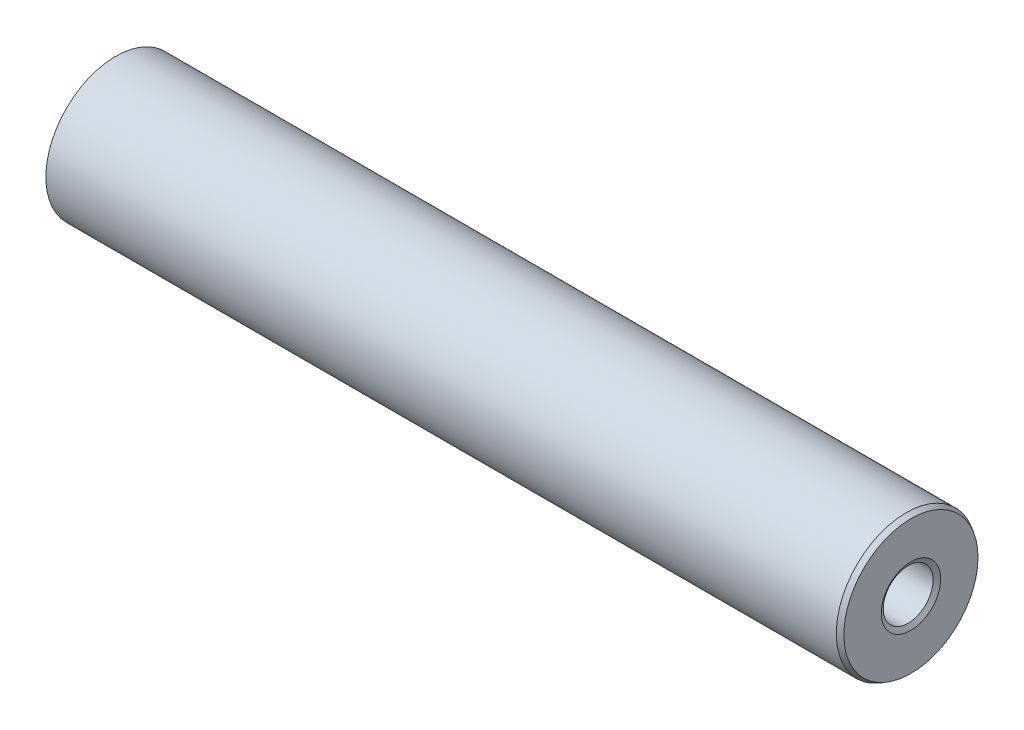
ISO-10303-21;
HEADER;
FILE_DESCRIPTION(('STEP AP214'),'2;1');
FILE_NAME('part.step','',(''),(''),'','','');
FILE_SCHEMA(('AUTOMOTIVE_DESIGN { 1 0 10303 214 1 1 1 1 }'));
ENDSEC;
DATA;
#1=APPLICATION_CONTEXT('core data for automotive mechanical design processes');
#2=APPLICATION_PROTOCOL_DEFINITION('international standard','automotive_design',2000,#1);
#3=PRODUCT_CONTEXT('',#1,'mechanical');
#4=PRODUCT('Part','Part','',(#3));
#5=PRODUCT_RELATED_PRODUCT_CATEGORY('part','',(#4));
#6=PRODUCT_DEFINITION_FORMATION('','',#4);
#7=PRODUCT_DEFINITION_CONTEXT('part definition',#1,'design');
#8=PRODUCT_DEFINITION('design','',#6,#7);
#9=PRODUCT_DEFINITION_SHAPE('','',#8);
#10=(LENGTH_UNIT() NAMED_UNIT(*) SI_UNIT(.MILLI.,.METRE.));
#11=(NAMED_UNIT(*) PLANE_ANGLE_UNIT() SI_UNIT($,.RADIAN.));
#12=(NAMED_UNIT(*) SI_UNIT($,.STERADIAN.) SOLID_ANGLE_UNIT());
#13=UNCERTAINTY_MEASURE_WITH_UNIT(LENGTH_MEASURE(1.E-05),#10,'distance_accuracy_value','');
#14=(GEOMETRIC_REPRESENTATION_CONTEXT(3) GLOBAL_UNCERTAINTY_ASSIGNED_CONTEXT((#13)) GLOBAL_UNIT_ASSIGNED_CONTEXT((#10,
#11,#12)) REPRESENTATION_CONTEXT('',''));
#15=CARTESIAN_POINT('',(0.,0.,0.));
#16=DIRECTION('',(0.,0.,1.));
#17=DIRECTION('',(1.,0.,0.));
#18=AXIS2_PLACEMENT_3D('',#15,#16,#17);
#19=CARTESIAN_POINT('',(127.,0.,0.));
#20=DIRECTION('',(1.,0.,0.));
#21=DIRECTION('',(0.,0.,-1.));
#22=AXIS2_PLACEMENT_3D('',#19,#20,#21);
#23=PLANE('',#22);
#24=CARTESIAN_POINT('',(127.,0.,0.));
#25=DIRECTION('',(1.,0.,0.));
#26=DIRECTION('',(0.,0.,-1.));
#27=AXIS2_PLACEMENT_3D('',#24,#25,#26);
#28=CIRCLE('',#27,10.6725590948775);
#29=CARTESIAN_POINT('',(127.,0.,-10.6725590948775));
#30=VERTEX_POINT('',#29);
#31=EDGE_CURVE('E59',#30,#30,#28,.T.);
#32=ORIENTED_EDGE('',*,*,#31,.T.);
#33=EDGE_LOOP('',(#32));
#34=FACE_BOUND('',#33,.T.);
#35=CARTESIAN_POINT('',(127.,0.,0.));
#36=DIRECTION('',(1.,0.,0.));
#37=DIRECTION('',(0.,0.,-1.));
#38=AXIS2_PLACEMENT_3D('',#35,#36,#37);
#39=CIRCLE('',#38,4.73074999999998);
#40=CARTESIAN_POINT('',(127.,0.,-4.73074999999998));
#41=VERTEX_POINT('',#40);
#42=EDGE_CURVE('E62',#41,#41,#39,.F.);
#43=ORIENTED_EDGE('',*,*,#42,.T.);
#44=EDGE_LOOP('',(#43));
#45=FACE_BOUND('',#44,.T.);
#46=ADVANCED_FACE('F33',(#34,#45),#23,.T.);
#47=CARTESIAN_POINT('',(0.,0.,0.));
#48=DIRECTION('',(1.,0.,0.));
#49=DIRECTION('',(0.,0.,-1.));
#50=AXIS2_PLACEMENT_3D('',#47,#48,#49);
#51=PLANE('',#50);
#52=CARTESIAN_POINT('',(0.,0.,0.));
#53=DIRECTION('',(1.,0.,0.));
#54=DIRECTION('',(0.,0.,-1.));
#55=AXIS2_PLACEMENT_3D('',#52,#53,#54);
#56=CIRCLE('',#55,4.40869090512248);
#57=CARTESIAN_POINT('',(0.,0.,-4.40869090512248));
#58=VERTEX_POINT('',#57);
#59=EDGE_CURVE('E10',#58,#58,#56,.T.);
#60=ORIENTED_EDGE('',*,*,#59,.T.);
#61=EDGE_LOOP('',(#60));
#62=FACE_BOUND('',#61,.T.);
#63=CARTESIAN_POINT('',(0.,0.,0.));
#64=DIRECTION('',(1.,0.,0.));
#65=DIRECTION('',(0.,0.,-1.));
#66=AXIS2_PLACEMENT_3D('',#63,#64,#65);
#67=CIRCLE('',#66,10.3505);
#68=CARTESIAN_POINT('',(0.,0.,-10.3505));
#69=VERTEX_POINT('',#68);
#70=EDGE_CURVE('E40',#69,#69,#67,.F.);
#71=ORIENTED_EDGE('',*,*,#70,.T.);
#72=EDGE_LOOP('',(#71));
#73=FACE_BOUND('',#72,.T.);
#74=ADVANCED_FACE('F89',(#62,#73),#51,.F.);
#75=CARTESIAN_POINT('',(127.,0.,0.));
#76=DIRECTION('',(-1.,0.,0.));
#77=DIRECTION('',(0.,0.,1.));
#78=AXIS2_PLACEMENT_3D('',#75,#76,#77);
#79=CYLINDRICAL_SURFACE('',#78,11.1125);
#80=CARTESIAN_POINT('',(126.238,0.,0.));
#81=DIRECTION('',(1.,0.,0.));
#82=DIRECTION('',(0.,0.,-1.));
#83=AXIS2_PLACEMENT_3D('',#80,#81,#82);
#84=CIRCLE('',#83,11.1125);
#85=CARTESIAN_POINT('',(126.238,0.,-11.1125));
#86=VERTEX_POINT('',#85);
#87=EDGE_CURVE('E53',#86,#86,#84,.F.);
#88=ORIENTED_EDGE('',*,*,#87,.T.);
#89=EDGE_LOOP('',(#88));
#90=FACE_BOUND('',#89,.T.);
#91=CARTESIAN_POINT('',(0.439940905122504,0.,0.));
#92=DIRECTION('',(1.,0.,0.));
#93=DIRECTION('',(0.,0.,-1.));
#94=AXIS2_PLACEMENT_3D('',#91,#92,#93);
#95=CIRCLE('',#94,11.1125);
#96=CARTESIAN_POINT('',(0.439940905122504,0.,-11.1125));
#97=VERTEX_POINT('',#96);
#98=EDGE_CURVE('E56',#97,#97,#95,.T.);
#99=ORIENTED_EDGE('',*,*,#98,.T.);
#100=EDGE_LOOP('',(#99));
#101=FACE_BOUND('',#100,.T.);
#102=ADVANCED_FACE('F78',(#90,#101),#79,.T.);
#103=CARTESIAN_POINT('',(127.,0.,0.));
#104=DIRECTION('',(-1.,0.,0.));
#105=DIRECTION('',(0.,0.,1.));
#106=AXIS2_PLACEMENT_3D('',#103,#104,#105);
#107=CYLINDRICAL_SURFACE('',#106,3.96875);
#108=CARTESIAN_POINT('',(126.560059094878,0.,0.));
#109=DIRECTION('',(1.,0.,0.));
#110=DIRECTION('',(0.,0.,-1.));
#111=AXIS2_PLACEMENT_3D('',#108,#109,#110);
#112=CIRCLE('',#111,3.96875);
#113=CARTESIAN_POINT('',(126.560059094878,0.,-3.96875));
#114=VERTEX_POINT('',#113);
#115=EDGE_CURVE('E44',#114,#114,#112,.T.);
#116=ORIENTED_EDGE('',*,*,#115,.T.);
#117=EDGE_LOOP('',(#116));
#118=FACE_BOUND('',#117,.T.);
#119=CARTESIAN_POINT('',(0.761999999999985,0.,0.));
#120=DIRECTION('',(1.,0.,0.));
#121=DIRECTION('',(0.,0.,-1.));
#122=AXIS2_PLACEMENT_3D('',#119,#120,#121);
#123=CIRCLE('',#122,3.96875);
#124=CARTESIAN_POINT('',(0.761999999999985,0.,-3.96875));
#125=VERTEX_POINT('',#124);
#126=EDGE_CURVE('E48',#125,#125,#123,.F.);
#127=ORIENTED_EDGE('',*,*,#126,.T.);
#128=EDGE_LOOP('',(#127));
#129=FACE_BOUND('',#128,.T.);
#130=ADVANCED_FACE('F75',(#118,#129),#107,.F.);
#131=CARTESIAN_POINT('',(127.,0.,0.));
#132=DIRECTION('',(-1.,0.,0.));
#133=DIRECTION('',(0.,0.,1.));
#134=AXIS2_PLACEMENT_3D('',#131,#132,#133);
#135=CONICAL_SURFACE('',#134,10.6725590948775,0.523598775598287);
#136=ORIENTED_EDGE('',*,*,#87,.F.);
#137=EDGE_LOOP('',(#136));
#138=FACE_BOUND('',#137,.T.);
#139=ORIENTED_EDGE('',*,*,#31,.F.);
#140=EDGE_LOOP('',(#139));
#141=FACE_BOUND('',#140,.T.);
#142=ADVANCED_FACE('F71',(#138,#141),#135,.T.);
#143=CARTESIAN_POINT('',(126.560059094878,0.,0.));
#144=DIRECTION('',(1.,0.,0.));
#145=DIRECTION('',(0.,0.,-1.));
#146=AXIS2_PLACEMENT_3D('',#143,#144,#145);
#147=CONICAL_SURFACE('',#146,3.96875,1.04719755119658);
#148=ORIENTED_EDGE('',*,*,#42,.F.);
#149=EDGE_LOOP('',(#148));
#150=FACE_BOUND('',#149,.T.);
#151=ORIENTED_EDGE('',*,*,#115,.F.);
#152=EDGE_LOOP('',(#151));
#153=FACE_BOUND('',#152,.T.);
#154=ADVANCED_FACE('F67',(#150,#153),#147,.F.);
#155=CARTESIAN_POINT('',(0.,0.,0.));
#156=DIRECTION('',(-1.,0.,0.));
#157=DIRECTION('',(0.,0.,1.));
#158=AXIS2_PLACEMENT_3D('',#155,#156,#157);
#159=CONICAL_SURFACE('',#158,4.40869090512248,0.523598775598296);
#160=ORIENTED_EDGE('',*,*,#126,.F.);
#161=EDGE_LOOP('',(#160));
#162=FACE_BOUND('',#161,.T.);
#163=ORIENTED_EDGE('',*,*,#59,.F.);
#164=EDGE_LOOP('',(#163));
#165=FACE_BOUND('',#164,.T.);
#166=ADVANCED_FACE('F70',(#162,#165),#159,.F.);
#167=CARTESIAN_POINT('',(0.439940905122504,0.,0.));
#168=DIRECTION('',(1.,0.,0.));
#169=DIRECTION('',(0.,0.,-1.));
#170=AXIS2_PLACEMENT_3D('',#167,#168,#169);
#171=CONICAL_SURFACE('',#170,11.1125,1.04719755119659);
#172=ORIENTED_EDGE('',*,*,#70,.F.);
#173=EDGE_LOOP('',(#172));
#174=FACE_BOUND('',#173,.T.);
#175=ORIENTED_EDGE('',*,*,#98,.F.);
#176=EDGE_LOOP('',(#175));
#177=FACE_BOUND('',#176,.T.);
#178=ADVANCED_FACE('F35',(#174,#177),#171,.T.);
#179=CLOSED_SHELL('',(#46,#74,#102,#130,#142,#154,#166,#178));
#180=MANIFOLD_SOLID_BREP('B2',#179);
#181=ADVANCED_BREP_SHAPE_REPRESENTATION('',(#18,#180),#14);
#182=SHAPE_DEFINITION_REPRESENTATION(#9,#181);
ENDSEC;
END-ISO-10303-21;
